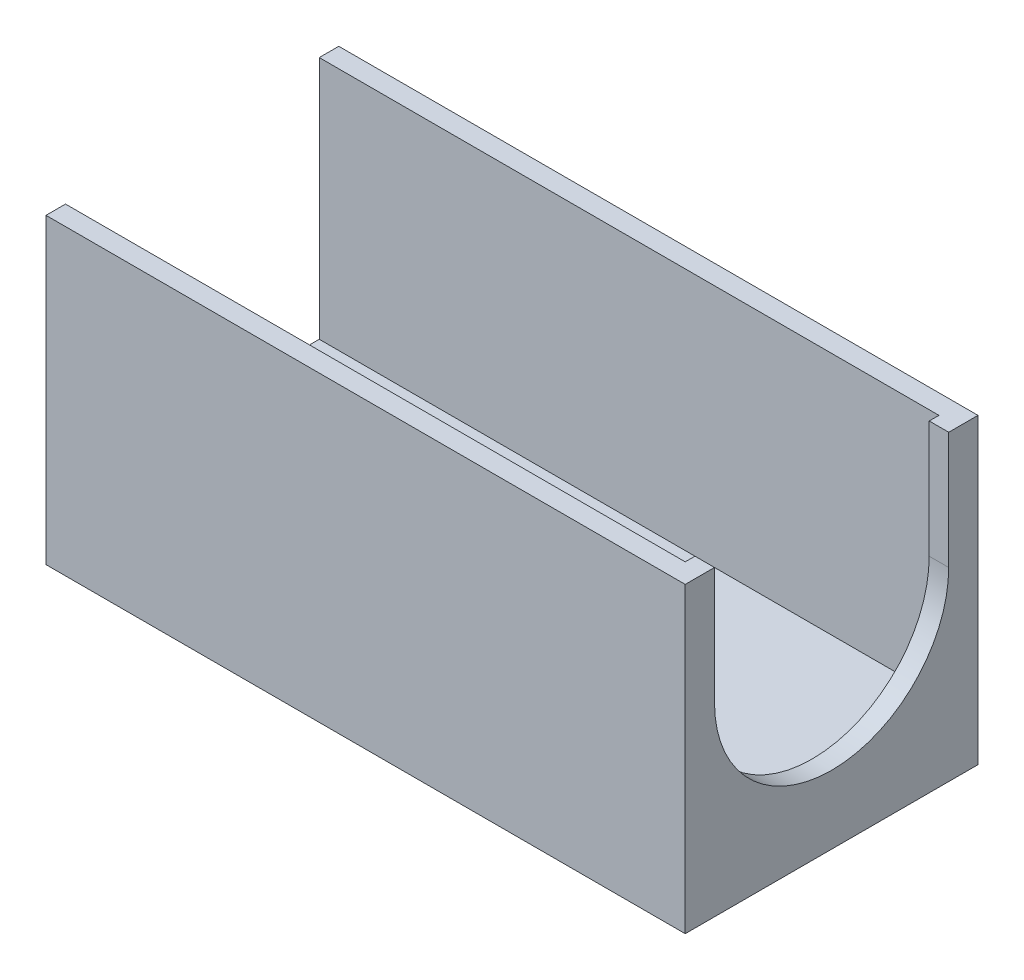
ISO-10303-21;
HEADER;
FILE_DESCRIPTION(('STEP AP214'),'2;1');
FILE_NAME('part.step','',(''),(''),'','','');
FILE_SCHEMA(('AUTOMOTIVE_DESIGN { 1 0 10303 214 1 1 1 1 }'));
ENDSEC;
DATA;
#1=APPLICATION_CONTEXT('core data for automotive mechanical design processes');
#2=APPLICATION_PROTOCOL_DEFINITION('international standard','automotive_design',2000,#1);
#3=PRODUCT_CONTEXT('',#1,'mechanical');
#4=PRODUCT('Part','Part','',(#3));
#5=PRODUCT_RELATED_PRODUCT_CATEGORY('part','',(#4));
#6=PRODUCT_DEFINITION_FORMATION('','',#4);
#7=PRODUCT_DEFINITION_CONTEXT('part definition',#1,'design');
#8=PRODUCT_DEFINITION('design','',#6,#7);
#9=PRODUCT_DEFINITION_SHAPE('','',#8);
#10=(LENGTH_UNIT() NAMED_UNIT(*) SI_UNIT(.MILLI.,.METRE.));
#11=(NAMED_UNIT(*) PLANE_ANGLE_UNIT() SI_UNIT($,.RADIAN.));
#12=(NAMED_UNIT(*) SI_UNIT($,.STERADIAN.) SOLID_ANGLE_UNIT());
#13=UNCERTAINTY_MEASURE_WITH_UNIT(LENGTH_MEASURE(1.E-05),#10,'distance_accuracy_value','');
#14=(GEOMETRIC_REPRESENTATION_CONTEXT(3) GLOBAL_UNCERTAINTY_ASSIGNED_CONTEXT((#13)) GLOBAL_UNIT_ASSIGNED_CONTEXT((#10,
#11,#12)) REPRESENTATION_CONTEXT('',''));
#15=CARTESIAN_POINT('',(0.,0.,0.));
#16=DIRECTION('',(0.,0.,1.));
#17=DIRECTION('',(1.,0.,0.));
#18=AXIS2_PLACEMENT_3D('',#15,#16,#17);
#19=CARTESIAN_POINT('',(0.,31.,0.));
#20=DIRECTION('',(0.,-1.,0.));
#21=DIRECTION('',(0.,0.,-1.));
#22=AXIS2_PLACEMENT_3D('',#19,#20,#21);
#23=PLANE('',#22);
#24=DIRECTION('',(0.,0.,-1.));
#25=VECTOR('',#24,1.);
#26=CARTESIAN_POINT('',(33.,31.,15.));
#27=LINE('',#26,#25);
#28=CARTESIAN_POINT('',(33.,31.,15.));
#29=VERTEX_POINT('',#28);
#30=CARTESIAN_POINT('',(33.,31.,12.));
#31=VERTEX_POINT('',#30);
#32=EDGE_CURVE('E252',#29,#31,#27,.T.);
#33=ORIENTED_EDGE('',*,*,#32,.T.);
#34=DIRECTION('',(1.,0.,0.));
#35=VECTOR('',#34,1.);
#36=CARTESIAN_POINT('',(31.,31.,12.));
#37=LINE('',#36,#35);
#38=CARTESIAN_POINT('',(31.,31.,12.));
#39=VERTEX_POINT('',#38);
#40=EDGE_CURVE('E179',#39,#31,#37,.T.);
#41=ORIENTED_EDGE('',*,*,#40,.F.);
#42=DIRECTION('',(0.,0.,-1.));
#43=VECTOR('',#42,1.);
#44=CARTESIAN_POINT('',(31.,31.,-13.));
#45=LINE('',#44,#43);
#46=CARTESIAN_POINT('',(31.,31.,13.));
#47=VERTEX_POINT('',#46);
#48=EDGE_CURVE('E242',#47,#39,#45,.T.);
#49=ORIENTED_EDGE('',*,*,#48,.F.);
#50=DIRECTION('',(1.,0.,0.));
#51=VECTOR('',#50,1.);
#52=CARTESIAN_POINT('',(-33.,31.,13.));
#53=LINE('',#52,#51);
#54=CARTESIAN_POINT('',(-32.5,31.,13.));
#55=VERTEX_POINT('',#54);
#56=EDGE_CURVE('E228',#55,#47,#53,.T.);
#57=ORIENTED_EDGE('',*,*,#56,.F.);
#58=DIRECTION('',(0.,0.,1.));
#59=VECTOR('',#58,1.);
#60=CARTESIAN_POINT('',(-32.5,31.,15.));
#61=LINE('',#60,#59);
#62=CARTESIAN_POINT('',(-32.5,31.,15.));
#63=VERTEX_POINT('',#62);
#64=EDGE_CURVE('E182',#55,#63,#61,.T.);
#65=ORIENTED_EDGE('',*,*,#64,.T.);
#66=DIRECTION('',(1.,0.,0.));
#67=VECTOR('',#66,1.);
#68=CARTESIAN_POINT('',(-33.,31.,15.));
#69=LINE('',#68,#67);
#70=EDGE_CURVE('E259',#63,#29,#69,.T.);
#71=ORIENTED_EDGE('',*,*,#70,.T.);
#72=EDGE_LOOP('',(#33,#41,#49,#57,#65,#71));
#73=FACE_BOUND('',#72,.T.);
#74=ADVANCED_FACE('F35',(#73),#23,.F.);
#75=CARTESIAN_POINT('',(-36.,3.,-15.));
#76=DIRECTION('',(0.,0.,1.));
#77=DIRECTION('',(1.,0.,0.));
#78=AXIS2_PLACEMENT_3D('',#75,#76,#77);
#79=CYLINDRICAL_SURFACE('',#78,3.);
#80=CARTESIAN_POINT('',(-36.,3.,-6.75));
#81=DIRECTION('',(0.,0.,-1.));
#82=DIRECTION('',(-1.,0.,0.));
#83=AXIS2_PLACEMENT_3D('',#80,#81,#82);
#84=CIRCLE('',#83,3.);
#85=CARTESIAN_POINT('',(-36.,6.,-6.75));
#86=VERTEX_POINT('',#85);
#87=CARTESIAN_POINT('',(-36.,0.,-6.75));
#88=VERTEX_POINT('',#87);
#89=EDGE_CURVE('E215',#86,#88,#84,.F.);
#90=ORIENTED_EDGE('',*,*,#89,.T.);
#91=DIRECTION('',(0.,0.,1.));
#92=VECTOR('',#91,1.);
#93=CARTESIAN_POINT('',(-36.,0.,-15.));
#94=LINE('',#93,#92);
#95=CARTESIAN_POINT('',(-36.,0.,6.75));
#96=VERTEX_POINT('',#95);
#97=EDGE_CURVE('E226',#88,#96,#94,.T.);
#98=ORIENTED_EDGE('',*,*,#97,.T.);
#99=CARTESIAN_POINT('',(-36.,3.,6.75));
#100=DIRECTION('',(0.,0.,-1.));
#101=DIRECTION('',(-1.,0.,0.));
#102=AXIS2_PLACEMENT_3D('',#99,#100,#101);
#103=CIRCLE('',#102,3.);
#104=CARTESIAN_POINT('',(-36.,6.,6.75));
#105=VERTEX_POINT('',#104);
#106=EDGE_CURVE('E223',#105,#96,#103,.F.);
#107=ORIENTED_EDGE('',*,*,#106,.F.);
#108=DIRECTION('',(0.,0.,1.));
#109=VECTOR('',#108,1.);
#110=CARTESIAN_POINT('',(-36.,6.,-15.));
#111=LINE('',#110,#109);
#112=EDGE_CURVE('E58',#86,#105,#111,.T.);
#113=ORIENTED_EDGE('',*,*,#112,.F.);
#114=EDGE_LOOP('',(#90,#98,#107,#113));
#115=FACE_BOUND('',#114,.T.);
#116=ADVANCED_FACE('F310',(#115),#79,.T.);
#117=CARTESIAN_POINT('',(-36.,3.,-15.));
#118=DIRECTION('',(0.,0.,1.));
#119=DIRECTION('',(1.,0.,0.));
#120=AXIS2_PLACEMENT_3D('',#117,#118,#119);
#121=CYLINDRICAL_SURFACE('',#120,0.999999999999998);
#122=CARTESIAN_POINT('',(-36.,3.,6.75));
#123=DIRECTION('',(0.,0.,-1.));
#124=DIRECTION('',(-1.,0.,0.));
#125=AXIS2_PLACEMENT_3D('',#122,#123,#124);
#126=CIRCLE('',#125,0.999999999999998);
#127=CARTESIAN_POINT('',(-37.,3.,6.75));
#128=VERTEX_POINT('',#127);
#129=EDGE_CURVE('E222',#128,#128,#126,.F.);
#130=ORIENTED_EDGE('',*,*,#129,.T.);
#131=EDGE_LOOP('',(#130));
#132=FACE_BOUND('',#131,.T.);
#133=CARTESIAN_POINT('',(-36.,3.,-6.75));
#134=DIRECTION('',(0.,0.,-1.));
#135=DIRECTION('',(-1.,0.,0.));
#136=AXIS2_PLACEMENT_3D('',#133,#134,#135);
#137=CIRCLE('',#136,0.999999999999998);
#138=CARTESIAN_POINT('',(-37.,3.,-6.75));
#139=VERTEX_POINT('',#138);
#140=EDGE_CURVE('E214',#139,#139,#137,.F.);
#141=ORIENTED_EDGE('',*,*,#140,.F.);
#142=EDGE_LOOP('',(#141));
#143=FACE_BOUND('',#142,.T.);
#144=ADVANCED_FACE('F344',(#132,#143),#121,.F.);
#145=CARTESIAN_POINT('',(33.,31.,15.));
#146=DIRECTION('',(-1.,0.,0.));
#147=DIRECTION('',(0.,0.,1.));
#148=AXIS2_PLACEMENT_3D('',#145,#146,#147);
#149=PLANE('',#148);
#150=CARTESIAN_POINT('',(33.,19.,0.));
#151=DIRECTION('',(1.,0.,0.));
#152=DIRECTION('',(0.,0.,-1.));
#153=AXIS2_PLACEMENT_3D('',#150,#151,#152);
#154=CIRCLE('',#153,12.);
#155=CARTESIAN_POINT('',(33.,19.,12.));
#156=VERTEX_POINT('',#155);
#157=CARTESIAN_POINT('',(33.,19.,-12.));
#158=VERTEX_POINT('',#157);
#159=EDGE_CURVE('E156',#156,#158,#154,.T.);
#160=ORIENTED_EDGE('',*,*,#159,.F.);
#161=DIRECTION('',(0.,-1.,0.));
#162=VECTOR('',#161,1.);
#163=CARTESIAN_POINT('',(33.,19.,12.));
#164=LINE('',#163,#162);
#165=EDGE_CURVE('E167',#31,#156,#164,.T.);
#166=ORIENTED_EDGE('',*,*,#165,.F.);
#167=ORIENTED_EDGE('',*,*,#32,.F.);
#168=DIRECTION('',(0.,-1.,0.));
#169=VECTOR('',#168,1.);
#170=CARTESIAN_POINT('',(33.,31.,15.));
#171=LINE('',#170,#169);
#172=CARTESIAN_POINT('',(33.,0.,15.));
#173=VERTEX_POINT('',#172);
#174=EDGE_CURVE('E261',#29,#173,#171,.T.);
#175=ORIENTED_EDGE('',*,*,#174,.T.);
#176=DIRECTION('',(0.,0.,-1.));
#177=VECTOR('',#176,1.);
#178=CARTESIAN_POINT('',(33.,0.,15.));
#179=LINE('',#178,#177);
#180=CARTESIAN_POINT('',(33.,0.,-15.));
#181=VERTEX_POINT('',#180);
#182=EDGE_CURVE('E249',#173,#181,#179,.T.);
#183=ORIENTED_EDGE('',*,*,#182,.T.);
#184=DIRECTION('',(0.,-1.,0.));
#185=VECTOR('',#184,1.);
#186=CARTESIAN_POINT('',(33.,31.,-15.));
#187=LINE('',#186,#185);
#188=CARTESIAN_POINT('',(33.,31.,-15.));
#189=VERTEX_POINT('',#188);
#190=EDGE_CURVE('E271',#189,#181,#187,.T.);
#191=ORIENTED_EDGE('',*,*,#190,.F.);
#192=CARTESIAN_POINT('',(33.,31.,-12.));
#193=VERTEX_POINT('',#192);
#194=EDGE_CURVE('E256',#193,#189,#27,.T.);
#195=ORIENTED_EDGE('',*,*,#194,.F.);
#196=DIRECTION('',(0.,1.,0.));
#197=VECTOR('',#196,1.);
#198=CARTESIAN_POINT('',(33.,19.,-12.));
#199=LINE('',#198,#197);
#200=EDGE_CURVE('E170',#158,#193,#199,.T.);
#201=ORIENTED_EDGE('',*,*,#200,.F.);
#202=EDGE_LOOP('',(#160,#166,#167,#175,#183,#191,#195,#201));
#203=FACE_BOUND('',#202,.T.);
#204=ADVANCED_FACE('F37',(#203),#149,.F.);
#205=CARTESIAN_POINT('',(-33.,31.,-15.));
#206=DIRECTION('',(0.,0.,1.));
#207=DIRECTION('',(1.,0.,0.));
#208=AXIS2_PLACEMENT_3D('',#205,#206,#207);
#209=PLANE('',#208);
#210=DIRECTION('',(-1.,0.,0.));
#211=VECTOR('',#210,1.);
#212=CARTESIAN_POINT('',(-33.,0.,-15.));
#213=LINE('',#212,#211);
#214=CARTESIAN_POINT('',(-32.5,0.,-15.));
#215=VERTEX_POINT('',#214);
#216=EDGE_CURVE('E264',#181,#215,#213,.T.);
#217=ORIENTED_EDGE('',*,*,#216,.T.);
#218=DIRECTION('',(0.,-1.,0.));
#219=VECTOR('',#218,1.);
#220=CARTESIAN_POINT('',(-32.5,31.,-15.));
#221=LINE('',#220,#219);
#222=CARTESIAN_POINT('',(-32.5,31.,-15.));
#223=VERTEX_POINT('',#222);
#224=EDGE_CURVE('E199',#223,#215,#221,.T.);
#225=ORIENTED_EDGE('',*,*,#224,.F.);
#226=DIRECTION('',(-1.,0.,0.));
#227=VECTOR('',#226,1.);
#228=CARTESIAN_POINT('',(-33.,31.,-15.));
#229=LINE('',#228,#227);
#230=EDGE_CURVE('E255',#189,#223,#229,.T.);
#231=ORIENTED_EDGE('',*,*,#230,.F.);
#232=ORIENTED_EDGE('',*,*,#190,.T.);
#233=EDGE_LOOP('',(#217,#225,#231,#232));
#234=FACE_BOUND('',#233,.T.);
#235=ADVANCED_FACE('F297',(#234),#209,.F.);
#236=CARTESIAN_POINT('',(-33.,31.,15.));
#237=DIRECTION('',(0.,0.,-1.));
#238=DIRECTION('',(-1.,0.,0.));
#239=AXIS2_PLACEMENT_3D('',#236,#237,#238);
#240=PLANE('',#239);
#241=ORIENTED_EDGE('',*,*,#70,.F.);
#242=DIRECTION('',(0.,-1.,0.));
#243=VECTOR('',#242,1.);
#244=CARTESIAN_POINT('',(-32.5,31.,15.));
#245=LINE('',#244,#243);
#246=CARTESIAN_POINT('',(-32.5,0.,15.));
#247=VERTEX_POINT('',#246);
#248=EDGE_CURVE('E187',#63,#247,#245,.T.);
#249=ORIENTED_EDGE('',*,*,#248,.T.);
#250=DIRECTION('',(1.,0.,0.));
#251=VECTOR('',#250,1.);
#252=CARTESIAN_POINT('',(-33.,0.,15.));
#253=LINE('',#252,#251);
#254=EDGE_CURVE('E267',#247,#173,#253,.T.);
#255=ORIENTED_EDGE('',*,*,#254,.T.);
#256=ORIENTED_EDGE('',*,*,#174,.F.);
#257=EDGE_LOOP('',(#241,#249,#255,#256));
#258=FACE_BOUND('',#257,.T.);
#259=ADVANCED_FACE('F331',(#258),#240,.F.);
#260=CARTESIAN_POINT('',(31.,31.,-12.));
#261=VERTEX_POINT('',#260);
#262=CARTESIAN_POINT('',(31.,31.,-13.));
#263=VERTEX_POINT('',#262);
#264=EDGE_CURVE('E241',#261,#263,#45,.T.);
#265=ORIENTED_EDGE('',*,*,#264,.F.);
#266=DIRECTION('',(1.,0.,0.));
#267=VECTOR('',#266,1.);
#268=CARTESIAN_POINT('',(31.,31.,-12.));
#269=LINE('',#268,#267);
#270=EDGE_CURVE('E50',#261,#193,#269,.T.);
#271=ORIENTED_EDGE('',*,*,#270,.T.);
#272=ORIENTED_EDGE('',*,*,#194,.T.);
#273=ORIENTED_EDGE('',*,*,#230,.T.);
#274=DIRECTION('',(0.,0.,1.));
#275=VECTOR('',#274,1.);
#276=CARTESIAN_POINT('',(-32.5,31.,-15.));
#277=LINE('',#276,#275);
#278=CARTESIAN_POINT('',(-32.5,31.,-13.));
#279=VERTEX_POINT('',#278);
#280=EDGE_CURVE('E196',#223,#279,#277,.T.);
#281=ORIENTED_EDGE('',*,*,#280,.T.);
#282=DIRECTION('',(-1.,0.,0.));
#283=VECTOR('',#282,1.);
#284=CARTESIAN_POINT('',(-33.,31.,-13.));
#285=LINE('',#284,#283);
#286=EDGE_CURVE('E233',#263,#279,#285,.T.);
#287=ORIENTED_EDGE('',*,*,#286,.F.);
#288=EDGE_LOOP('',(#265,#271,#272,#273,#281,#287));
#289=FACE_BOUND('',#288,.T.);
#290=ADVANCED_FACE('F292',(#289),#23,.F.);
#291=CARTESIAN_POINT('',(0.,0.,0.));
#292=DIRECTION('',(0.,-1.,0.));
#293=DIRECTION('',(0.,0.,-1.));
#294=AXIS2_PLACEMENT_3D('',#291,#292,#293);
#295=PLANE('',#294);
#296=DIRECTION('',(0.,0.,1.));
#297=VECTOR('',#296,1.);
#298=CARTESIAN_POINT('',(-32.5,0.,15.));
#299=LINE('',#298,#297);
#300=CARTESIAN_POINT('',(-32.5,0.,6.75));
#301=VERTEX_POINT('',#300);
#302=EDGE_CURVE('E178',#301,#247,#299,.T.);
#303=ORIENTED_EDGE('',*,*,#302,.F.);
#304=DIRECTION('',(1.,0.,0.));
#305=VECTOR('',#304,1.);
#306=CARTESIAN_POINT('',(-33.,0.,6.75));
#307=LINE('',#306,#305);
#308=EDGE_CURVE('E220',#96,#301,#307,.T.);
#309=ORIENTED_EDGE('',*,*,#308,.F.);
#310=ORIENTED_EDGE('',*,*,#97,.F.);
#311=DIRECTION('',(-1.,0.,0.));
#312=VECTOR('',#311,1.);
#313=CARTESIAN_POINT('',(-33.,0.,-6.75));
#314=LINE('',#313,#312);
#315=CARTESIAN_POINT('',(-32.5,0.,-6.75));
#316=VERTEX_POINT('',#315);
#317=EDGE_CURVE('E209',#316,#88,#314,.T.);
#318=ORIENTED_EDGE('',*,*,#317,.F.);
#319=DIRECTION('',(0.,0.,1.));
#320=VECTOR('',#319,1.);
#321=CARTESIAN_POINT('',(-32.5,0.,-15.));
#322=LINE('',#321,#320);
#323=EDGE_CURVE('E195',#215,#316,#322,.T.);
#324=ORIENTED_EDGE('',*,*,#323,.F.);
#325=ORIENTED_EDGE('',*,*,#216,.F.);
#326=ORIENTED_EDGE('',*,*,#182,.F.);
#327=ORIENTED_EDGE('',*,*,#254,.F.);
#328=EDGE_LOOP('',(#303,#309,#310,#318,#324,#325,#326,#327));
#329=FACE_BOUND('',#328,.T.);
#330=ADVANCED_FACE('F302',(#329),#295,.T.);
#331=CARTESIAN_POINT('',(-33.,6.,-13.));
#332=DIRECTION('',(0.,0.,-1.));
#333=DIRECTION('',(-1.,0.,0.));
#334=AXIS2_PLACEMENT_3D('',#331,#332,#333);
#335=PLANE('',#334);
#336=ORIENTED_EDGE('',*,*,#286,.T.);
#337=DIRECTION('',(0.,-1.,0.));
#338=VECTOR('',#337,1.);
#339=CARTESIAN_POINT('',(-32.5,6.,-13.));
#340=LINE('',#339,#338);
#341=CARTESIAN_POINT('',(-32.5,6.,-13.));
#342=VERTEX_POINT('',#341);
#343=EDGE_CURVE('E205',#279,#342,#340,.T.);
#344=ORIENTED_EDGE('',*,*,#343,.T.);
#345=DIRECTION('',(-1.,0.,0.));
#346=VECTOR('',#345,1.);
#347=CARTESIAN_POINT('',(-33.,6.,-13.));
#348=LINE('',#347,#346);
#349=CARTESIAN_POINT('',(31.,6.,-13.));
#350=VERTEX_POINT('',#349);
#351=EDGE_CURVE('E236',#350,#342,#348,.T.);
#352=ORIENTED_EDGE('',*,*,#351,.F.);
#353=DIRECTION('',(0.,1.,0.));
#354=VECTOR('',#353,1.);
#355=CARTESIAN_POINT('',(31.,6.,-13.));
#356=LINE('',#355,#354);
#357=EDGE_CURVE('E246',#350,#263,#356,.T.);
#358=ORIENTED_EDGE('',*,*,#357,.T.);
#359=EDGE_LOOP('',(#336,#344,#352,#358));
#360=FACE_BOUND('',#359,.T.);
#361=ADVANCED_FACE('F283',(#360),#335,.F.);
#362=CARTESIAN_POINT('',(31.,6.,-13.));
#363=DIRECTION('',(1.,0.,0.));
#364=DIRECTION('',(0.,0.,-1.));
#365=AXIS2_PLACEMENT_3D('',#362,#363,#364);
#366=PLANE('',#365);
#367=ORIENTED_EDGE('',*,*,#48,.T.);
#368=DIRECTION('',(0.,-1.,0.));
#369=VECTOR('',#368,1.);
#370=CARTESIAN_POINT('',(31.,19.,12.));
#371=LINE('',#370,#369);
#372=CARTESIAN_POINT('',(31.,19.,12.));
#373=VERTEX_POINT('',#372);
#374=EDGE_CURVE('E158',#39,#373,#371,.T.);
#375=ORIENTED_EDGE('',*,*,#374,.T.);
#376=CARTESIAN_POINT('',(31.,19.,0.));
#377=DIRECTION('',(1.,0.,0.));
#378=DIRECTION('',(0.,0.,-1.));
#379=AXIS2_PLACEMENT_3D('',#376,#377,#378);
#380=CIRCLE('',#379,12.);
#381=CARTESIAN_POINT('',(31.,19.,-12.));
#382=VERTEX_POINT('',#381);
#383=EDGE_CURVE('E153',#373,#382,#380,.T.);
#384=ORIENTED_EDGE('',*,*,#383,.T.);
#385=DIRECTION('',(0.,1.,0.));
#386=VECTOR('',#385,1.);
#387=CARTESIAN_POINT('',(31.,19.,-12.));
#388=LINE('',#387,#386);
#389=EDGE_CURVE('E160',#382,#261,#388,.T.);
#390=ORIENTED_EDGE('',*,*,#389,.T.);
#391=ORIENTED_EDGE('',*,*,#264,.T.);
#392=ORIENTED_EDGE('',*,*,#357,.F.);
#393=DIRECTION('',(0.,0.,-1.));
#394=VECTOR('',#393,1.);
#395=CARTESIAN_POINT('',(31.,6.,-13.));
#396=LINE('',#395,#394);
#397=CARTESIAN_POINT('',(31.,6.,13.));
#398=VERTEX_POINT('',#397);
#399=EDGE_CURVE('E232',#398,#350,#396,.T.);
#400=ORIENTED_EDGE('',*,*,#399,.F.);
#401=DIRECTION('',(0.,1.,0.));
#402=VECTOR('',#401,1.);
#403=CARTESIAN_POINT('',(31.,6.,13.));
#404=LINE('',#403,#402);
#405=EDGE_CURVE('E239',#398,#47,#404,.T.);
#406=ORIENTED_EDGE('',*,*,#405,.T.);
#407=EDGE_LOOP('',(#367,#375,#384,#390,#391,#392,#400,#406));
#408=FACE_BOUND('',#407,.T.);
#409=ADVANCED_FACE('F166',(#408),#366,.F.);
#410=CARTESIAN_POINT('',(-33.,6.,13.));
#411=DIRECTION('',(0.,0.,1.));
#412=DIRECTION('',(1.,0.,0.));
#413=AXIS2_PLACEMENT_3D('',#410,#411,#412);
#414=PLANE('',#413);
#415=DIRECTION('',(1.,0.,0.));
#416=VECTOR('',#415,1.);
#417=CARTESIAN_POINT('',(-33.,6.,13.));
#418=LINE('',#417,#416);
#419=CARTESIAN_POINT('',(-32.5,6.,13.));
#420=VERTEX_POINT('',#419);
#421=EDGE_CURVE('E230',#420,#398,#418,.T.);
#422=ORIENTED_EDGE('',*,*,#421,.F.);
#423=DIRECTION('',(0.,1.,0.));
#424=VECTOR('',#423,1.);
#425=CARTESIAN_POINT('',(-32.5,6.,13.));
#426=LINE('',#425,#424);
#427=EDGE_CURVE('E190',#420,#55,#426,.T.);
#428=ORIENTED_EDGE('',*,*,#427,.T.);
#429=ORIENTED_EDGE('',*,*,#56,.T.);
#430=ORIENTED_EDGE('',*,*,#405,.F.);
#431=EDGE_LOOP('',(#422,#428,#429,#430));
#432=FACE_BOUND('',#431,.T.);
#433=ADVANCED_FACE('F319',(#432),#414,.F.);
#434=CARTESIAN_POINT('',(0.,6.,0.));
#435=DIRECTION('',(0.,1.,0.));
#436=DIRECTION('',(0.,0.,1.));
#437=AXIS2_PLACEMENT_3D('',#434,#435,#436);
#438=PLANE('',#437);
#439=DIRECTION('',(0.,0.,-1.));
#440=VECTOR('',#439,1.);
#441=CARTESIAN_POINT('',(-32.5,6.,0.));
#442=LINE('',#441,#440);
#443=CARTESIAN_POINT('',(-32.5,6.,6.75));
#444=VERTEX_POINT('',#443);
#445=EDGE_CURVE('E11',#420,#444,#442,.T.);
#446=ORIENTED_EDGE('',*,*,#445,.F.);
#447=ORIENTED_EDGE('',*,*,#421,.T.);
#448=ORIENTED_EDGE('',*,*,#399,.T.);
#449=ORIENTED_EDGE('',*,*,#351,.T.);
#450=DIRECTION('',(0.,0.,-1.));
#451=VECTOR('',#450,1.);
#452=CARTESIAN_POINT('',(-32.5,6.,0.));
#453=LINE('',#452,#451);
#454=CARTESIAN_POINT('',(-32.5,6.,-6.75));
#455=VERTEX_POINT('',#454);
#456=EDGE_CURVE('E43',#455,#342,#453,.T.);
#457=ORIENTED_EDGE('',*,*,#456,.F.);
#458=DIRECTION('',(1.,0.,0.));
#459=VECTOR('',#458,1.);
#460=CARTESIAN_POINT('',(-33.,6.,-6.75));
#461=LINE('',#460,#459);
#462=EDGE_CURVE('E212',#86,#455,#461,.T.);
#463=ORIENTED_EDGE('',*,*,#462,.F.);
#464=ORIENTED_EDGE('',*,*,#112,.T.);
#465=DIRECTION('',(-1.,0.,0.));
#466=VECTOR('',#465,1.);
#467=CARTESIAN_POINT('',(-33.,6.,6.75));
#468=LINE('',#467,#466);
#469=EDGE_CURVE('E217',#444,#105,#468,.T.);
#470=ORIENTED_EDGE('',*,*,#469,.F.);
#471=EDGE_LOOP('',(#446,#447,#448,#449,#457,#463,#464,#470));
#472=FACE_BOUND('',#471,.T.);
#473=ADVANCED_FACE('F286',(#472),#438,.T.);
#474=CARTESIAN_POINT('',(0.,0.,6.75));
#475=DIRECTION('',(0.,0.,-1.));
#476=DIRECTION('',(-1.,0.,0.));
#477=AXIS2_PLACEMENT_3D('',#474,#475,#476);
#478=PLANE('',#477);
#479=ORIENTED_EDGE('',*,*,#106,.T.);
#480=ORIENTED_EDGE('',*,*,#308,.T.);
#481=DIRECTION('',(0.,-1.,0.));
#482=VECTOR('',#481,1.);
#483=CARTESIAN_POINT('',(-32.5,31.,6.75));
#484=LINE('',#483,#482);
#485=EDGE_CURVE('E185',#444,#301,#484,.T.);
#486=ORIENTED_EDGE('',*,*,#485,.F.);
#487=ORIENTED_EDGE('',*,*,#469,.T.);
#488=EDGE_LOOP('',(#479,#480,#486,#487));
#489=FACE_BOUND('',#488,.T.);
#490=ORIENTED_EDGE('',*,*,#129,.F.);
#491=EDGE_LOOP('',(#490));
#492=FACE_BOUND('',#491,.T.);
#493=ADVANCED_FACE('F313',(#489,#492),#478,.F.);
#494=CARTESIAN_POINT('',(0.,0.,-6.75));
#495=DIRECTION('',(0.,0.,-1.));
#496=DIRECTION('',(-1.,0.,0.));
#497=AXIS2_PLACEMENT_3D('',#494,#495,#496);
#498=PLANE('',#497);
#499=ORIENTED_EDGE('',*,*,#89,.F.);
#500=ORIENTED_EDGE('',*,*,#462,.T.);
#501=DIRECTION('',(0.,-1.,0.));
#502=VECTOR('',#501,1.);
#503=CARTESIAN_POINT('',(-32.5,31.,-6.75));
#504=LINE('',#503,#502);
#505=EDGE_CURVE('E202',#455,#316,#504,.T.);
#506=ORIENTED_EDGE('',*,*,#505,.T.);
#507=ORIENTED_EDGE('',*,*,#317,.T.);
#508=EDGE_LOOP('',(#499,#500,#506,#507));
#509=FACE_BOUND('',#508,.T.);
#510=ORIENTED_EDGE('',*,*,#140,.T.);
#511=EDGE_LOOP('',(#510));
#512=FACE_BOUND('',#511,.T.);
#513=ADVANCED_FACE('F307',(#509,#512),#498,.T.);
#514=CARTESIAN_POINT('',(-32.5,31.,-15.));
#515=DIRECTION('',(1.,0.,0.));
#516=DIRECTION('',(0.,0.,-1.));
#517=AXIS2_PLACEMENT_3D('',#514,#515,#516);
#518=PLANE('',#517);
#519=ORIENTED_EDGE('',*,*,#280,.F.);
#520=ORIENTED_EDGE('',*,*,#224,.T.);
#521=ORIENTED_EDGE('',*,*,#323,.T.);
#522=ORIENTED_EDGE('',*,*,#505,.F.);
#523=ORIENTED_EDGE('',*,*,#456,.T.);
#524=ORIENTED_EDGE('',*,*,#343,.F.);
#525=EDGE_LOOP('',(#519,#520,#521,#522,#523,#524));
#526=FACE_BOUND('',#525,.T.);
#527=ADVANCED_FACE('F280',(#526),#518,.F.);
#528=CARTESIAN_POINT('',(-32.5,31.,15.));
#529=DIRECTION('',(1.,0.,0.));
#530=DIRECTION('',(0.,0.,-1.));
#531=AXIS2_PLACEMENT_3D('',#528,#529,#530);
#532=PLANE('',#531);
#533=ORIENTED_EDGE('',*,*,#445,.T.);
#534=ORIENTED_EDGE('',*,*,#485,.T.);
#535=ORIENTED_EDGE('',*,*,#302,.T.);
#536=ORIENTED_EDGE('',*,*,#248,.F.);
#537=ORIENTED_EDGE('',*,*,#64,.F.);
#538=ORIENTED_EDGE('',*,*,#427,.F.);
#539=EDGE_LOOP('',(#533,#534,#535,#536,#537,#538));
#540=FACE_BOUND('',#539,.T.);
#541=ADVANCED_FACE('F316',(#540),#532,.F.);
#542=CARTESIAN_POINT('',(31.,19.,0.));
#543=DIRECTION('',(1.,0.,0.));
#544=DIRECTION('',(0.,0.,-1.));
#545=AXIS2_PLACEMENT_3D('',#542,#543,#544);
#546=CYLINDRICAL_SURFACE('',#545,12.);
#547=ORIENTED_EDGE('',*,*,#159,.T.);
#548=DIRECTION('',(1.,0.,0.));
#549=VECTOR('',#548,1.);
#550=CARTESIAN_POINT('',(31.,19.,-12.));
#551=LINE('',#550,#549);
#552=EDGE_CURVE('E150',#382,#158,#551,.T.);
#553=ORIENTED_EDGE('',*,*,#552,.F.);
#554=ORIENTED_EDGE('',*,*,#383,.F.);
#555=DIRECTION('',(1.,0.,0.));
#556=VECTOR('',#555,1.);
#557=CARTESIAN_POINT('',(31.,19.,12.));
#558=LINE('',#557,#556);
#559=EDGE_CURVE('E176',#373,#156,#558,.T.);
#560=ORIENTED_EDGE('',*,*,#559,.T.);
#561=EDGE_LOOP('',(#547,#553,#554,#560));
#562=FACE_BOUND('',#561,.T.);
#563=ADVANCED_FACE('F151',(#562),#546,.F.);
#564=CARTESIAN_POINT('',(31.,19.,12.));
#565=DIRECTION('',(0.,0.,1.));
#566=DIRECTION('',(1.,0.,0.));
#567=AXIS2_PLACEMENT_3D('',#564,#565,#566);
#568=PLANE('',#567);
#569=ORIENTED_EDGE('',*,*,#165,.T.);
#570=ORIENTED_EDGE('',*,*,#559,.F.);
#571=ORIENTED_EDGE('',*,*,#374,.F.);
#572=ORIENTED_EDGE('',*,*,#40,.T.);
#573=EDGE_LOOP('',(#569,#570,#571,#572));
#574=FACE_BOUND('',#573,.T.);
#575=ADVANCED_FACE('F326',(#574),#568,.F.);
#576=CARTESIAN_POINT('',(31.,19.,-12.));
#577=DIRECTION('',(0.,0.,-1.));
#578=DIRECTION('',(-1.,0.,0.));
#579=AXIS2_PLACEMENT_3D('',#576,#577,#578);
#580=PLANE('',#579);
#581=ORIENTED_EDGE('',*,*,#200,.T.);
#582=ORIENTED_EDGE('',*,*,#270,.F.);
#583=ORIENTED_EDGE('',*,*,#389,.F.);
#584=ORIENTED_EDGE('',*,*,#552,.T.);
#585=EDGE_LOOP('',(#581,#582,#583,#584));
#586=FACE_BOUND('',#585,.T.);
#587=ADVANCED_FACE('F161',(#586),#580,.F.);
#588=CLOSED_SHELL('',(#74,#116,#144,#204,#235,#259,#290,#330,#361,#409,#433,#473,#493,#513,#527,
#541,#563,#575,#587));
#589=MANIFOLD_SOLID_BREP('B2',#588);
#590=ADVANCED_BREP_SHAPE_REPRESENTATION('',(#18,#589),#14);
#591=SHAPE_DEFINITION_REPRESENTATION(#9,#590);
ENDSEC;
END-ISO-10303-21;
